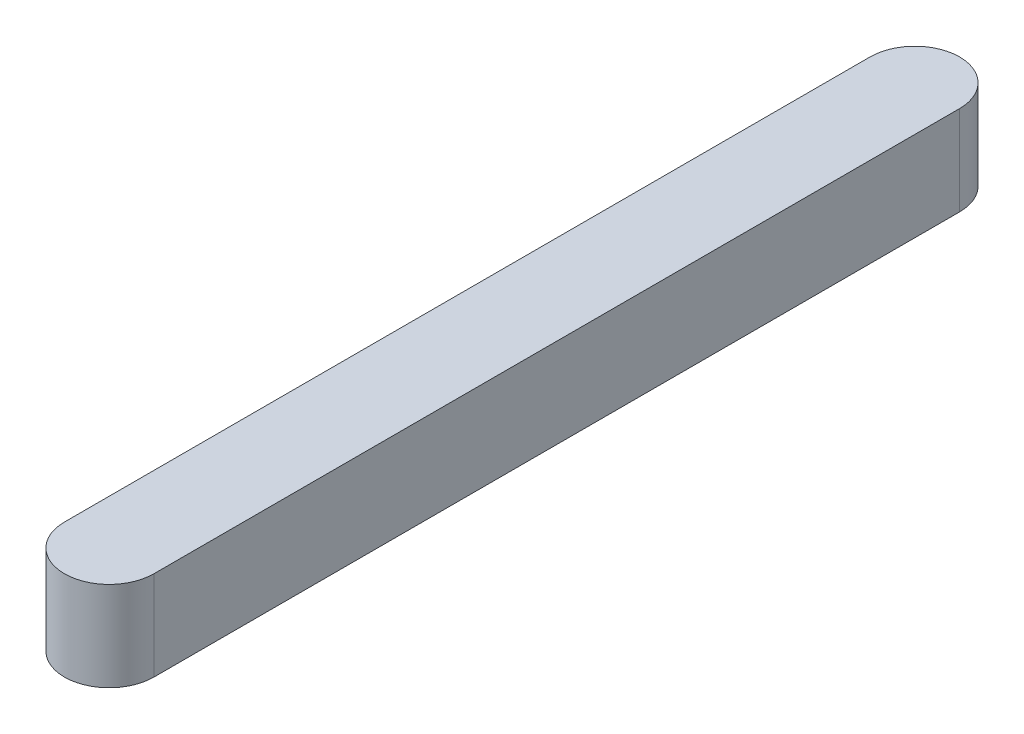
ISO-10303-21;
HEADER;
FILE_DESCRIPTION(('STEP AP214'),'2;1');
FILE_NAME('part.step','',(''),(''),'','','');
FILE_SCHEMA(('AUTOMOTIVE_DESIGN { 1 0 10303 214 1 1 1 1 }'));
ENDSEC;
DATA;
#1=APPLICATION_CONTEXT('core data for automotive mechanical design processes');
#2=APPLICATION_PROTOCOL_DEFINITION('international standard','automotive_design',2000,#1);
#3=PRODUCT_CONTEXT('',#1,'mechanical');
#4=PRODUCT('Part','Part','',(#3));
#5=PRODUCT_RELATED_PRODUCT_CATEGORY('part','',(#4));
#6=PRODUCT_DEFINITION_FORMATION('','',#4);
#7=PRODUCT_DEFINITION_CONTEXT('part definition',#1,'design');
#8=PRODUCT_DEFINITION('design','',#6,#7);
#9=PRODUCT_DEFINITION_SHAPE('','',#8);
#10=(LENGTH_UNIT() NAMED_UNIT(*) SI_UNIT(.MILLI.,.METRE.));
#11=(NAMED_UNIT(*) PLANE_ANGLE_UNIT() SI_UNIT($,.RADIAN.));
#12=(NAMED_UNIT(*) SI_UNIT($,.STERADIAN.) SOLID_ANGLE_UNIT());
#13=UNCERTAINTY_MEASURE_WITH_UNIT(LENGTH_MEASURE(1.E-05),#10,'distance_accuracy_value','');
#14=(GEOMETRIC_REPRESENTATION_CONTEXT(3) GLOBAL_UNCERTAINTY_ASSIGNED_CONTEXT((#13)) GLOBAL_UNIT_ASSIGNED_CONTEXT((#10,
#11,#12)) REPRESENTATION_CONTEXT('',''));
#15=CARTESIAN_POINT('',(0.,0.,0.));
#16=DIRECTION('',(0.,0.,1.));
#17=DIRECTION('',(1.,0.,0.));
#18=AXIS2_PLACEMENT_3D('',#15,#16,#17);
#19=CARTESIAN_POINT('',(-1.,1.,10.));
#20=DIRECTION('',(0.,-1.,0.));
#21=DIRECTION('',(0.,0.,-1.));
#22=AXIS2_PLACEMENT_3D('',#19,#20,#21);
#23=PLANE('',#22);
#24=CARTESIAN_POINT('',(0.,1.,-9.));
#25=DIRECTION('',(0.,1.,0.));
#26=DIRECTION('',(0.,0.,1.));
#27=AXIS2_PLACEMENT_3D('',#24,#25,#26);
#28=CIRCLE('',#27,0.999999999999999);
#29=CARTESIAN_POINT('',(-1.,1.,-9.));
#30=VERTEX_POINT('',#29);
#31=CARTESIAN_POINT('',(0.999999999999999,1.,-9.));
#32=VERTEX_POINT('',#31);
#33=EDGE_CURVE('E83',#30,#32,#28,.F.);
#34=ORIENTED_EDGE('',*,*,#33,.F.);
#35=DIRECTION('',(0.,0.,-1.));
#36=VECTOR('',#35,1.);
#37=CARTESIAN_POINT('',(-1.,1.,10.));
#38=LINE('',#37,#36);
#39=CARTESIAN_POINT('',(-1.,1.,9.));
#40=VERTEX_POINT('',#39);
#41=EDGE_CURVE('E60',#30,#40,#38,.F.);
#42=ORIENTED_EDGE('',*,*,#41,.T.);
#43=CARTESIAN_POINT('',(0.,1.,9.));
#44=DIRECTION('',(0.,1.,0.));
#45=DIRECTION('',(0.,0.,1.));
#46=AXIS2_PLACEMENT_3D('',#43,#44,#45);
#47=CIRCLE('',#46,1.);
#48=CARTESIAN_POINT('',(1.,1.,9.));
#49=VERTEX_POINT('',#48);
#50=EDGE_CURVE('E21',#49,#40,#47,.F.);
#51=ORIENTED_EDGE('',*,*,#50,.F.);
#52=DIRECTION('',(0.,0.,1.));
#53=VECTOR('',#52,1.);
#54=CARTESIAN_POINT('',(1.,1.,10.));
#55=LINE('',#54,#53);
#56=EDGE_CURVE('E57',#49,#32,#55,.F.);
#57=ORIENTED_EDGE('',*,*,#56,.T.);
#58=EDGE_LOOP('',(#34,#42,#51,#57));
#59=FACE_BOUND('',#58,.T.);
#60=ADVANCED_FACE('F18',(#59),#23,.F.);
#61=CARTESIAN_POINT('',(0.,1.,9.));
#62=DIRECTION('',(0.,1.,0.));
#63=DIRECTION('',(0.,0.,1.));
#64=AXIS2_PLACEMENT_3D('',#61,#62,#63);
#65=CYLINDRICAL_SURFACE('',#64,1.);
#66=ORIENTED_EDGE('',*,*,#50,.T.);
#67=DIRECTION('',(0.,1.,0.));
#68=VECTOR('',#67,1.);
#69=CARTESIAN_POINT('',(-1.,-1.,9.));
#70=LINE('',#69,#68);
#71=CARTESIAN_POINT('',(-1.,-1.,9.));
#72=VERTEX_POINT('',#71);
#73=EDGE_CURVE('E84',#40,#72,#70,.F.);
#74=ORIENTED_EDGE('',*,*,#73,.T.);
#75=CARTESIAN_POINT('',(0.,-1.,9.));
#76=DIRECTION('',(0.,-1.,0.));
#77=DIRECTION('',(0.,0.,-1.));
#78=AXIS2_PLACEMENT_3D('',#75,#76,#77);
#79=CIRCLE('',#78,1.);
#80=CARTESIAN_POINT('',(1.,-1.,9.));
#81=VERTEX_POINT('',#80);
#82=EDGE_CURVE('E74',#72,#81,#79,.F.);
#83=ORIENTED_EDGE('',*,*,#82,.T.);
#84=DIRECTION('',(0.,1.,0.));
#85=VECTOR('',#84,1.);
#86=CARTESIAN_POINT('',(1.,-1.,9.));
#87=LINE('',#86,#85);
#88=EDGE_CURVE('E65',#81,#49,#87,.T.);
#89=ORIENTED_EDGE('',*,*,#88,.T.);
#90=EDGE_LOOP('',(#66,#74,#83,#89));
#91=FACE_BOUND('',#90,.T.);
#92=ADVANCED_FACE('F73',(#91),#65,.T.);
#93=CARTESIAN_POINT('',(1.,-1.,10.));
#94=DIRECTION('',(-1.,0.,0.));
#95=DIRECTION('',(0.,0.,1.));
#96=AXIS2_PLACEMENT_3D('',#93,#94,#95);
#97=PLANE('',#96);
#98=DIRECTION('',(0.,-1.,0.));
#99=VECTOR('',#98,1.);
#100=CARTESIAN_POINT('',(0.999999999999999,-1.,-9.));
#101=LINE('',#100,#99);
#102=CARTESIAN_POINT('',(0.999999999999999,-1.,-9.));
#103=VERTEX_POINT('',#102);
#104=EDGE_CURVE('E71',#32,#103,#101,.T.);
#105=ORIENTED_EDGE('',*,*,#104,.F.);
#106=ORIENTED_EDGE('',*,*,#56,.F.);
#107=ORIENTED_EDGE('',*,*,#88,.F.);
#108=DIRECTION('',(0.,0.,1.));
#109=VECTOR('',#108,1.);
#110=CARTESIAN_POINT('',(1.,-1.,10.));
#111=LINE('',#110,#109);
#112=EDGE_CURVE('E82',#81,#103,#111,.F.);
#113=ORIENTED_EDGE('',*,*,#112,.T.);
#114=EDGE_LOOP('',(#105,#106,#107,#113));
#115=FACE_BOUND('',#114,.T.);
#116=ADVANCED_FACE('F68',(#115),#97,.F.);
#117=CARTESIAN_POINT('',(0.,-1.,-9.));
#118=DIRECTION('',(0.,1.,0.));
#119=DIRECTION('',(0.,0.,1.));
#120=AXIS2_PLACEMENT_3D('',#117,#118,#119);
#121=CYLINDRICAL_SURFACE('',#120,0.999999999999999);
#122=CARTESIAN_POINT('',(0.,-1.,-9.));
#123=DIRECTION('',(0.,-1.,0.));
#124=DIRECTION('',(0.,0.,-1.));
#125=AXIS2_PLACEMENT_3D('',#122,#123,#124);
#126=CIRCLE('',#125,0.999999999999999);
#127=CARTESIAN_POINT('',(-1.,-1.,-9.));
#128=VERTEX_POINT('',#127);
#129=EDGE_CURVE('E27',#103,#128,#126,.F.);
#130=ORIENTED_EDGE('',*,*,#129,.T.);
#131=DIRECTION('',(0.,1.,0.));
#132=VECTOR('',#131,1.);
#133=CARTESIAN_POINT('',(-1.,-1.,-9.));
#134=LINE('',#133,#132);
#135=EDGE_CURVE('E79',#128,#30,#134,.T.);
#136=ORIENTED_EDGE('',*,*,#135,.T.);
#137=ORIENTED_EDGE('',*,*,#33,.T.);
#138=ORIENTED_EDGE('',*,*,#104,.T.);
#139=EDGE_LOOP('',(#130,#136,#137,#138));
#140=FACE_BOUND('',#139,.T.);
#141=ADVANCED_FACE('F85',(#140),#121,.T.);
#142=CARTESIAN_POINT('',(-1.,-1.,10.));
#143=DIRECTION('',(1.,0.,0.));
#144=DIRECTION('',(0.,0.,-1.));
#145=AXIS2_PLACEMENT_3D('',#142,#143,#144);
#146=PLANE('',#145);
#147=ORIENTED_EDGE('',*,*,#135,.F.);
#148=DIRECTION('',(0.,0.,1.));
#149=VECTOR('',#148,1.);
#150=CARTESIAN_POINT('',(-1.,-1.,10.));
#151=LINE('',#150,#149);
#152=EDGE_CURVE('E11',#128,#72,#151,.T.);
#153=ORIENTED_EDGE('',*,*,#152,.T.);
#154=ORIENTED_EDGE('',*,*,#73,.F.);
#155=ORIENTED_EDGE('',*,*,#41,.F.);
#156=EDGE_LOOP('',(#147,#153,#154,#155));
#157=FACE_BOUND('',#156,.T.);
#158=ADVANCED_FACE('F92',(#157),#146,.F.);
#159=CARTESIAN_POINT('',(-1.,-1.,10.));
#160=DIRECTION('',(0.,1.,0.));
#161=DIRECTION('',(0.,0.,1.));
#162=AXIS2_PLACEMENT_3D('',#159,#160,#161);
#163=PLANE('',#162);
#164=ORIENTED_EDGE('',*,*,#152,.F.);
#165=ORIENTED_EDGE('',*,*,#129,.F.);
#166=ORIENTED_EDGE('',*,*,#112,.F.);
#167=ORIENTED_EDGE('',*,*,#82,.F.);
#168=EDGE_LOOP('',(#164,#165,#166,#167));
#169=FACE_BOUND('',#168,.T.);
#170=ADVANCED_FACE('F88',(#169),#163,.F.);
#171=CLOSED_SHELL('',(#60,#92,#116,#141,#158,#170));
#172=MANIFOLD_SOLID_BREP('B1',#171);
#173=ADVANCED_BREP_SHAPE_REPRESENTATION('',(#18,#172),#14);
#174=SHAPE_DEFINITION_REPRESENTATION(#9,#173);
ENDSEC;
END-ISO-10303-21;
